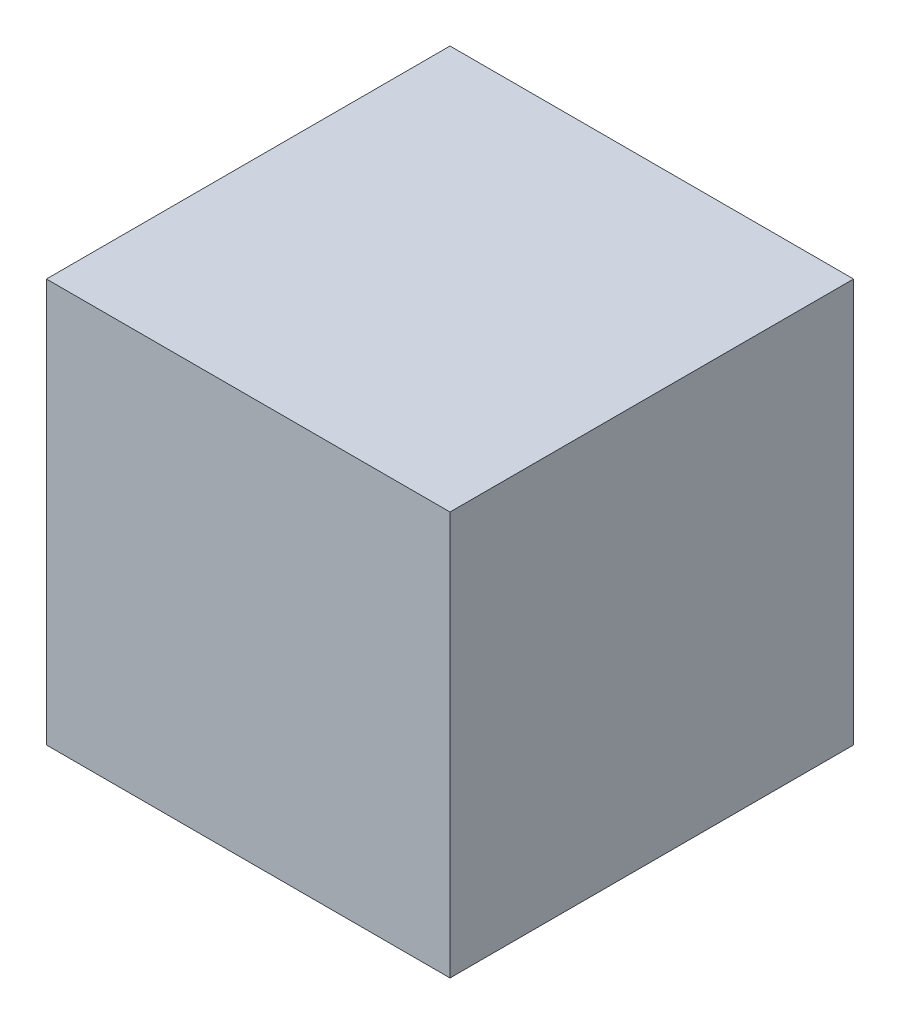
ISO-10303-21;
HEADER;
FILE_DESCRIPTION(('STEP AP214'),'2;1');
FILE_NAME('part.step','',(''),(''),'','','');
FILE_SCHEMA(('AUTOMOTIVE_DESIGN { 1 0 10303 214 1 1 1 1 }'));
ENDSEC;
DATA;
#1=APPLICATION_CONTEXT('core data for automotive mechanical design processes');
#2=APPLICATION_PROTOCOL_DEFINITION('international standard','automotive_design',2000,#1);
#3=PRODUCT_CONTEXT('',#1,'mechanical');
#4=PRODUCT('Part','Part','',(#3));
#5=PRODUCT_RELATED_PRODUCT_CATEGORY('part','',(#4));
#6=PRODUCT_DEFINITION_FORMATION('','',#4);
#7=PRODUCT_DEFINITION_CONTEXT('part definition',#1,'design');
#8=PRODUCT_DEFINITION('design','',#6,#7);
#9=PRODUCT_DEFINITION_SHAPE('','',#8);
#10=(LENGTH_UNIT() NAMED_UNIT(*) SI_UNIT(.MILLI.,.METRE.));
#11=(NAMED_UNIT(*) PLANE_ANGLE_UNIT() SI_UNIT($,.RADIAN.));
#12=(NAMED_UNIT(*) SI_UNIT($,.STERADIAN.) SOLID_ANGLE_UNIT());
#13=UNCERTAINTY_MEASURE_WITH_UNIT(LENGTH_MEASURE(1.E-05),#10,'distance_accuracy_value','');
#14=(GEOMETRIC_REPRESENTATION_CONTEXT(3) GLOBAL_UNCERTAINTY_ASSIGNED_CONTEXT((#13)) GLOBAL_UNIT_ASSIGNED_CONTEXT((#10,
#11,#12)) REPRESENTATION_CONTEXT('',''));
#15=CARTESIAN_POINT('',(0.,0.,0.));
#16=DIRECTION('',(0.,0.,1.));
#17=DIRECTION('',(1.,0.,0.));
#18=AXIS2_PLACEMENT_3D('',#15,#16,#17);
#19=CARTESIAN_POINT('',(-190.5,-190.5,381.));
#20=DIRECTION('',(1.,0.,0.));
#21=DIRECTION('',(0.,0.,-1.));
#22=AXIS2_PLACEMENT_3D('',#19,#20,#21);
#23=PLANE('',#22);
#24=DIRECTION('',(0.,-1.,0.));
#25=VECTOR('',#24,1.);
#26=CARTESIAN_POINT('',(-190.5,-190.5,0.));
#27=LINE('',#26,#25);
#28=CARTESIAN_POINT('',(-190.5,190.5,0.));
#29=VERTEX_POINT('',#28);
#30=CARTESIAN_POINT('',(-190.5,-190.5,0.));
#31=VERTEX_POINT('',#30);
#32=EDGE_CURVE('E107',#29,#31,#27,.T.);
#33=ORIENTED_EDGE('',*,*,#32,.T.);
#34=DIRECTION('',(0.,0.,-1.));
#35=VECTOR('',#34,1.);
#36=CARTESIAN_POINT('',(-190.5,-190.5,381.));
#37=LINE('',#36,#35);
#38=CARTESIAN_POINT('',(-190.5,-190.5,381.));
#39=VERTEX_POINT('',#38);
#40=EDGE_CURVE('E11',#39,#31,#37,.T.);
#41=ORIENTED_EDGE('',*,*,#40,.F.);
#42=DIRECTION('',(0.,-1.,0.));
#43=VECTOR('',#42,1.);
#44=CARTESIAN_POINT('',(-190.5,-190.5,381.));
#45=LINE('',#44,#43);
#46=CARTESIAN_POINT('',(-190.5,190.5,381.));
#47=VERTEX_POINT('',#46);
#48=EDGE_CURVE('E91',#47,#39,#45,.T.);
#49=ORIENTED_EDGE('',*,*,#48,.F.);
#50=DIRECTION('',(0.,0.,-1.));
#51=VECTOR('',#50,1.);
#52=CARTESIAN_POINT('',(-190.5,190.5,381.));
#53=LINE('',#52,#51);
#54=EDGE_CURVE('E103',#47,#29,#53,.T.);
#55=ORIENTED_EDGE('',*,*,#54,.T.);
#56=EDGE_LOOP('',(#33,#41,#49,#55));
#57=FACE_BOUND('',#56,.T.);
#58=ADVANCED_FACE('F39',(#57),#23,.F.);
#59=CARTESIAN_POINT('',(190.5,-190.5,381.));
#60=DIRECTION('',(0.,1.,0.));
#61=DIRECTION('',(-1.,0.,0.));
#62=AXIS2_PLACEMENT_3D('',#59,#60,#61);
#63=PLANE('',#62);
#64=DIRECTION('',(1.,0.,0.));
#65=VECTOR('',#64,1.);
#66=CARTESIAN_POINT('',(190.5,-190.5,0.));
#67=LINE('',#66,#65);
#68=CARTESIAN_POINT('',(190.5,-190.5,0.));
#69=VERTEX_POINT('',#68);
#70=EDGE_CURVE('E96',#31,#69,#67,.T.);
#71=ORIENTED_EDGE('',*,*,#70,.T.);
#72=DIRECTION('',(0.,0.,-1.));
#73=VECTOR('',#72,1.);
#74=CARTESIAN_POINT('',(190.5,-190.5,381.));
#75=LINE('',#74,#73);
#76=CARTESIAN_POINT('',(190.5,-190.5,381.));
#77=VERTEX_POINT('',#76);
#78=EDGE_CURVE('E48',#77,#69,#75,.T.);
#79=ORIENTED_EDGE('',*,*,#78,.F.);
#80=DIRECTION('',(1.,0.,0.));
#81=VECTOR('',#80,1.);
#82=CARTESIAN_POINT('',(190.5,-190.5,381.));
#83=LINE('',#82,#81);
#84=EDGE_CURVE('E86',#39,#77,#83,.T.);
#85=ORIENTED_EDGE('',*,*,#84,.F.);
#86=ORIENTED_EDGE('',*,*,#40,.T.);
#87=EDGE_LOOP('',(#71,#79,#85,#86));
#88=FACE_BOUND('',#87,.T.);
#89=ADVANCED_FACE('F95',(#88),#63,.F.);
#90=CARTESIAN_POINT('',(190.5,-190.5,381.));
#91=DIRECTION('',(-1.,0.,0.));
#92=DIRECTION('',(0.,0.,1.));
#93=AXIS2_PLACEMENT_3D('',#90,#91,#92);
#94=PLANE('',#93);
#95=DIRECTION('',(0.,1.,0.));
#96=VECTOR('',#95,1.);
#97=CARTESIAN_POINT('',(190.5,-190.5,0.));
#98=LINE('',#97,#96);
#99=CARTESIAN_POINT('',(190.5,190.5,0.));
#100=VERTEX_POINT('',#99);
#101=EDGE_CURVE('E73',#69,#100,#98,.T.);
#102=ORIENTED_EDGE('',*,*,#101,.T.);
#103=DIRECTION('',(0.,0.,-1.));
#104=VECTOR('',#103,1.);
#105=CARTESIAN_POINT('',(190.5,190.5,381.));
#106=LINE('',#105,#104);
#107=CARTESIAN_POINT('',(190.5,190.5,381.));
#108=VERTEX_POINT('',#107);
#109=EDGE_CURVE('E98',#108,#100,#106,.T.);
#110=ORIENTED_EDGE('',*,*,#109,.F.);
#111=DIRECTION('',(0.,1.,0.));
#112=VECTOR('',#111,1.);
#113=CARTESIAN_POINT('',(190.5,-190.5,381.));
#114=LINE('',#113,#112);
#115=EDGE_CURVE('E89',#77,#108,#114,.T.);
#116=ORIENTED_EDGE('',*,*,#115,.F.);
#117=ORIENTED_EDGE('',*,*,#78,.T.);
#118=EDGE_LOOP('',(#102,#110,#116,#117));
#119=FACE_BOUND('',#118,.T.);
#120=ADVANCED_FACE('F99',(#119),#94,.F.);
#121=CARTESIAN_POINT('',(190.5,190.5,381.));
#122=DIRECTION('',(0.,-1.,0.));
#123=DIRECTION('',(1.,0.,0.));
#124=AXIS2_PLACEMENT_3D('',#121,#122,#123);
#125=PLANE('',#124);
#126=DIRECTION('',(-1.,0.,0.));
#127=VECTOR('',#126,1.);
#128=CARTESIAN_POINT('',(190.5,190.5,0.));
#129=LINE('',#128,#127);
#130=EDGE_CURVE('E79',#100,#29,#129,.T.);
#131=ORIENTED_EDGE('',*,*,#130,.T.);
#132=ORIENTED_EDGE('',*,*,#54,.F.);
#133=DIRECTION('',(-1.,0.,0.));
#134=VECTOR('',#133,1.);
#135=CARTESIAN_POINT('',(190.5,190.5,381.));
#136=LINE('',#135,#134);
#137=EDGE_CURVE('E56',#108,#47,#136,.T.);
#138=ORIENTED_EDGE('',*,*,#137,.F.);
#139=ORIENTED_EDGE('',*,*,#109,.T.);
#140=EDGE_LOOP('',(#131,#132,#138,#139));
#141=FACE_BOUND('',#140,.T.);
#142=ADVANCED_FACE('F120',(#141),#125,.F.);
#143=CARTESIAN_POINT('',(0.,0.,381.));
#144=DIRECTION('',(0.,0.,1.));
#145=DIRECTION('',(1.,0.,0.));
#146=AXIS2_PLACEMENT_3D('',#143,#144,#145);
#147=PLANE('',#146);
#148=ORIENTED_EDGE('',*,*,#48,.T.);
#149=ORIENTED_EDGE('',*,*,#84,.T.);
#150=ORIENTED_EDGE('',*,*,#115,.T.);
#151=ORIENTED_EDGE('',*,*,#137,.T.);
#152=EDGE_LOOP('',(#148,#149,#150,#151));
#153=FACE_BOUND('',#152,.T.);
#154=ADVANCED_FACE('F87',(#153),#147,.T.);
#155=CARTESIAN_POINT('',(0.,0.,0.));
#156=DIRECTION('',(0.,0.,1.));
#157=DIRECTION('',(1.,0.,0.));
#158=AXIS2_PLACEMENT_3D('',#155,#156,#157);
#159=PLANE('',#158);
#160=ORIENTED_EDGE('',*,*,#32,.F.);
#161=ORIENTED_EDGE('',*,*,#130,.F.);
#162=ORIENTED_EDGE('',*,*,#101,.F.);
#163=ORIENTED_EDGE('',*,*,#70,.F.);
#164=EDGE_LOOP('',(#160,#161,#162,#163));
#165=FACE_BOUND('',#164,.T.);
#166=ADVANCED_FACE('F123',(#165),#159,.F.);
#167=CLOSED_SHELL('',(#58,#89,#120,#142,#154,#166));
#168=MANIFOLD_SOLID_BREP('B2',#167);
#169=ADVANCED_BREP_SHAPE_REPRESENTATION('',(#18,#168),#14);
#170=SHAPE_DEFINITION_REPRESENTATION(#9,#169);
ENDSEC;
END-ISO-10303-21;
